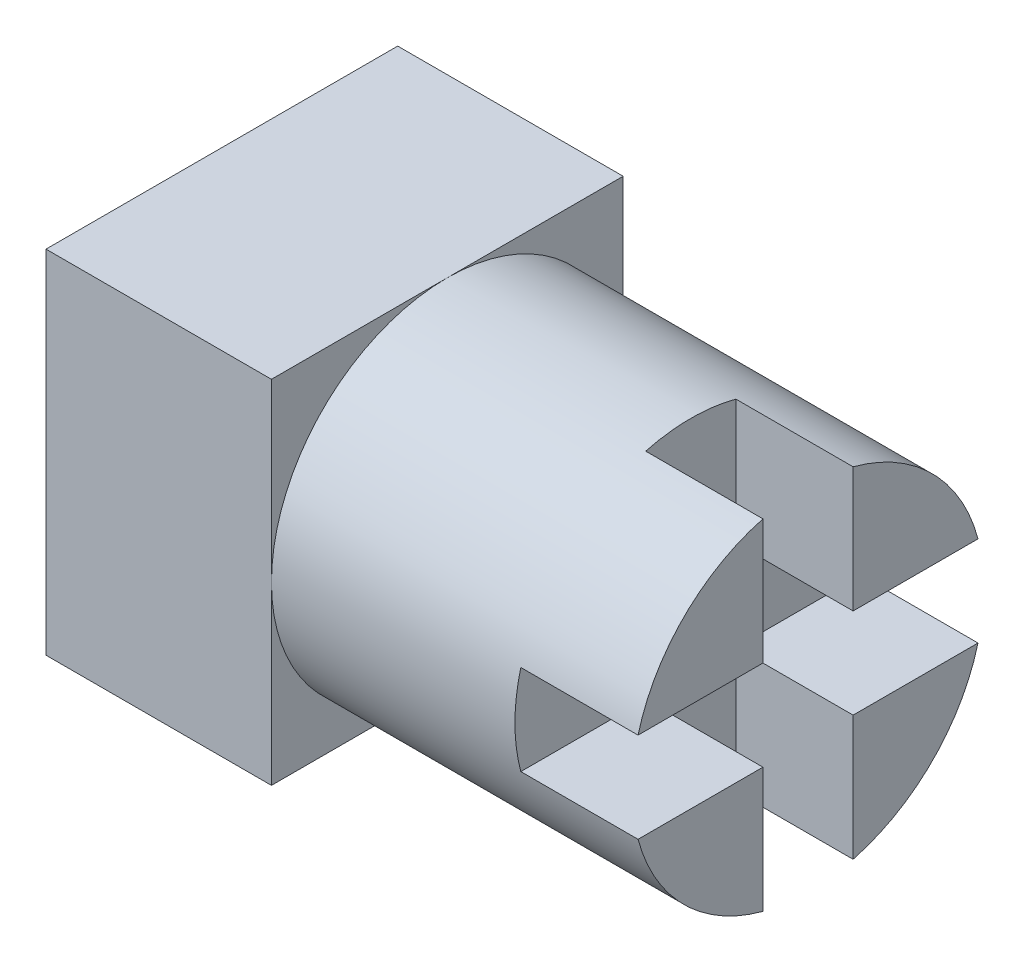
ISO-10303-21;
HEADER;
FILE_DESCRIPTION(('STEP AP214'),'2;1');
FILE_NAME('part.step','',(''),(''),'','','');
FILE_SCHEMA(('AUTOMOTIVE_DESIGN { 1 0 10303 214 1 1 1 1 }'));
ENDSEC;
DATA;
#1=APPLICATION_CONTEXT('core data for automotive mechanical design processes');
#2=APPLICATION_PROTOCOL_DEFINITION('international standard','automotive_design',2000,#1);
#3=PRODUCT_CONTEXT('',#1,'mechanical');
#4=PRODUCT('Part','Part','',(#3));
#5=PRODUCT_RELATED_PRODUCT_CATEGORY('part','',(#4));
#6=PRODUCT_DEFINITION_FORMATION('','',#4);
#7=PRODUCT_DEFINITION_CONTEXT('part definition',#1,'design');
#8=PRODUCT_DEFINITION('design','',#6,#7);
#9=PRODUCT_DEFINITION_SHAPE('','',#8);
#10=(LENGTH_UNIT() NAMED_UNIT(*) SI_UNIT(.MILLI.,.METRE.));
#11=(NAMED_UNIT(*) PLANE_ANGLE_UNIT() SI_UNIT($,.RADIAN.));
#12=(NAMED_UNIT(*) SI_UNIT($,.STERADIAN.) SOLID_ANGLE_UNIT());
#13=UNCERTAINTY_MEASURE_WITH_UNIT(LENGTH_MEASURE(1.E-05),#10,'distance_accuracy_value','');
#14=(GEOMETRIC_REPRESENTATION_CONTEXT(3) GLOBAL_UNCERTAINTY_ASSIGNED_CONTEXT((#13)) GLOBAL_UNIT_ASSIGNED_CONTEXT((#10,
#11,#12)) REPRESENTATION_CONTEXT('',''));
#15=CARTESIAN_POINT('',(0.,0.,0.));
#16=DIRECTION('',(0.,0.,1.));
#17=DIRECTION('',(1.,0.,0.));
#18=AXIS2_PLACEMENT_3D('',#15,#16,#17);
#19=CARTESIAN_POINT('',(26.,0.,0.));
#20=DIRECTION('',(-1.,0.,0.));
#21=DIRECTION('',(0.,0.,1.));
#22=AXIS2_PLACEMENT_3D('',#19,#20,#21);
#23=CYLINDRICAL_SURFACE('',#22,7.8);
#24=CARTESIAN_POINT('',(10.,0.,0.));
#25=DIRECTION('',(1.,0.,0.));
#26=DIRECTION('',(0.,0.,-1.));
#27=AXIS2_PLACEMENT_3D('',#24,#25,#26);
#28=CIRCLE('',#27,7.8);
#29=CARTESIAN_POINT('',(10.,0.,-7.8));
#30=VERTEX_POINT('',#29);
#31=CARTESIAN_POINT('',(10.,7.8,0.));
#32=VERTEX_POINT('',#31);
#33=EDGE_CURVE('E267',#30,#32,#28,.T.);
#34=ORIENTED_EDGE('',*,*,#33,.T.);
#35=CARTESIAN_POINT('',(10.,0.,7.8));
#36=VERTEX_POINT('',#35);
#37=EDGE_CURVE('E277',#32,#36,#28,.T.);
#38=ORIENTED_EDGE('',*,*,#37,.T.);
#39=CARTESIAN_POINT('',(10.,-7.8,0.));
#40=VERTEX_POINT('',#39);
#41=EDGE_CURVE('E443',#36,#40,#28,.T.);
#42=ORIENTED_EDGE('',*,*,#41,.T.);
#43=EDGE_CURVE('E68',#40,#30,#28,.T.);
#44=ORIENTED_EDGE('',*,*,#43,.T.);
#45=EDGE_LOOP('',(#34,#38,#42,#44));
#46=FACE_BOUND('',#45,.T.);
#47=CARTESIAN_POINT('',(26.,0.,0.));
#48=DIRECTION('',(1.,0.,0.));
#49=DIRECTION('',(0.,0.,-1.));
#50=AXIS2_PLACEMENT_3D('',#47,#48,#49);
#51=CIRCLE('',#50,7.8);
#52=CARTESIAN_POINT('',(26.,7.53923072998831,2.));
#53=VERTEX_POINT('',#52);
#54=CARTESIAN_POINT('',(26.,2.,7.53923072998831));
#55=VERTEX_POINT('',#54);
#56=EDGE_CURVE('E356',#53,#55,#51,.T.);
#57=ORIENTED_EDGE('',*,*,#56,.F.);
#58=DIRECTION('',(-1.,0.,0.));
#59=VECTOR('',#58,1.);
#60=CARTESIAN_POINT('',(26.,7.53923072998831,2.));
#61=LINE('',#60,#59);
#62=CARTESIAN_POINT('',(20.8,7.53923072998831,2.));
#63=VERTEX_POINT('',#62);
#64=EDGE_CURVE('E255',#53,#63,#61,.T.);
#65=ORIENTED_EDGE('',*,*,#64,.T.);
#66=CARTESIAN_POINT('',(20.8,0.,0.));
#67=DIRECTION('',(1.,0.,0.));
#68=DIRECTION('',(0.,0.,-1.));
#69=AXIS2_PLACEMENT_3D('',#66,#67,#68);
#70=CIRCLE('',#69,7.8);
#71=CARTESIAN_POINT('',(20.8,7.53923072998831,-2.));
#72=VERTEX_POINT('',#71);
#73=EDGE_CURVE('E11',#72,#63,#70,.T.);
#74=ORIENTED_EDGE('',*,*,#73,.F.);
#75=DIRECTION('',(-1.,0.,0.));
#76=VECTOR('',#75,1.);
#77=CARTESIAN_POINT('',(26.,7.53923072998831,-2.));
#78=LINE('',#77,#76);
#79=CARTESIAN_POINT('',(26.,7.53923072998831,-2.));
#80=VERTEX_POINT('',#79);
#81=EDGE_CURVE('E251',#80,#72,#78,.T.);
#82=ORIENTED_EDGE('',*,*,#81,.F.);
#83=CARTESIAN_POINT('',(26.,2.,-7.53923072998831));
#84=VERTEX_POINT('',#83);
#85=EDGE_CURVE('E273',#84,#80,#51,.T.);
#86=ORIENTED_EDGE('',*,*,#85,.F.);
#87=DIRECTION('',(-1.,0.,0.));
#88=VECTOR('',#87,1.);
#89=CARTESIAN_POINT('',(26.,2.,-7.53923072998831));
#90=LINE('',#89,#88);
#91=CARTESIAN_POINT('',(20.8,2.,-7.53923072998831));
#92=VERTEX_POINT('',#91);
#93=EDGE_CURVE('E248',#92,#84,#90,.F.);
#94=ORIENTED_EDGE('',*,*,#93,.F.);
#95=CARTESIAN_POINT('',(20.8,-2.,-7.53923072998831));
#96=VERTEX_POINT('',#95);
#97=EDGE_CURVE('E47',#96,#92,#70,.T.);
#98=ORIENTED_EDGE('',*,*,#97,.F.);
#99=DIRECTION('',(-1.,0.,0.));
#100=VECTOR('',#99,1.);
#101=CARTESIAN_POINT('',(26.,-2.,-7.53923072998831));
#102=LINE('',#101,#100);
#103=CARTESIAN_POINT('',(26.,-2.,-7.53923072998831));
#104=VERTEX_POINT('',#103);
#105=EDGE_CURVE('E192',#96,#104,#102,.F.);
#106=ORIENTED_EDGE('',*,*,#105,.T.);
#107=CARTESIAN_POINT('',(26.,-7.53923072998831,-2.));
#108=VERTEX_POINT('',#107);
#109=EDGE_CURVE('E268',#108,#104,#51,.T.);
#110=ORIENTED_EDGE('',*,*,#109,.F.);
#111=DIRECTION('',(1.,0.,0.));
#112=VECTOR('',#111,1.);
#113=CARTESIAN_POINT('',(20.8,-7.53923072998831,-2.));
#114=LINE('',#113,#112);
#115=CARTESIAN_POINT('',(20.8,-7.53923072998831,-2.));
#116=VERTEX_POINT('',#115);
#117=EDGE_CURVE('E229',#116,#108,#114,.T.);
#118=ORIENTED_EDGE('',*,*,#117,.F.);
#119=CARTESIAN_POINT('',(20.8,0.,0.));
#120=DIRECTION('',(1.,0.,0.));
#121=DIRECTION('',(0.,0.,-1.));
#122=AXIS2_PLACEMENT_3D('',#119,#120,#121);
#123=CIRCLE('',#122,7.8);
#124=CARTESIAN_POINT('',(20.8,-7.53923072998831,2.));
#125=VERTEX_POINT('',#124);
#126=EDGE_CURVE('E176',#125,#116,#123,.T.);
#127=ORIENTED_EDGE('',*,*,#126,.F.);
#128=DIRECTION('',(1.,0.,0.));
#129=VECTOR('',#128,1.);
#130=CARTESIAN_POINT('',(20.8,-7.53923072998831,2.));
#131=LINE('',#130,#129);
#132=CARTESIAN_POINT('',(26.,-7.53923072998831,2.));
#133=VERTEX_POINT('',#132);
#134=EDGE_CURVE('E232',#125,#133,#131,.T.);
#135=ORIENTED_EDGE('',*,*,#134,.T.);
#136=CARTESIAN_POINT('',(26.,-2.,7.53923072998831));
#137=VERTEX_POINT('',#136);
#138=EDGE_CURVE('E272',#137,#133,#51,.T.);
#139=ORIENTED_EDGE('',*,*,#138,.F.);
#140=DIRECTION('',(-1.,0.,0.));
#141=VECTOR('',#140,1.);
#142=CARTESIAN_POINT('',(26.,-2.,7.53923072998831));
#143=LINE('',#142,#141);
#144=CARTESIAN_POINT('',(20.8,-2.,7.53923072998831));
#145=VERTEX_POINT('',#144);
#146=EDGE_CURVE('E263',#137,#145,#143,.T.);
#147=ORIENTED_EDGE('',*,*,#146,.T.);
#148=CARTESIAN_POINT('',(20.8,2.,7.53923072998831));
#149=VERTEX_POINT('',#148);
#150=EDGE_CURVE('E53',#149,#145,#70,.T.);
#151=ORIENTED_EDGE('',*,*,#150,.F.);
#152=DIRECTION('',(-1.,0.,0.));
#153=VECTOR('',#152,1.);
#154=CARTESIAN_POINT('',(26.,2.,7.53923072998831));
#155=LINE('',#154,#153);
#156=EDGE_CURVE('E259',#55,#149,#155,.T.);
#157=ORIENTED_EDGE('',*,*,#156,.F.);
#158=EDGE_LOOP('',(#57,#65,#74,#82,#86,#94,#98,#106,#110,#118,#127,#135,#139,#147,#151,#157));
#159=FACE_BOUND('',#158,.T.);
#160=ADVANCED_FACE('F43',(#46,#159),#23,.T.);
#161=CARTESIAN_POINT('',(26.,0.,0.));
#162=DIRECTION('',(1.,0.,0.));
#163=DIRECTION('',(0.,0.,-1.));
#164=AXIS2_PLACEMENT_3D('',#161,#162,#163);
#165=PLANE('',#164);
#166=ORIENTED_EDGE('',*,*,#56,.T.);
#167=DIRECTION('',(0.,0.,-1.));
#168=VECTOR('',#167,1.);
#169=CARTESIAN_POINT('',(26.,2.,0.));
#170=LINE('',#169,#168);
#171=CARTESIAN_POINT('',(26.,2.,2.));
#172=VERTEX_POINT('',#171);
#173=EDGE_CURVE('E333',#55,#172,#170,.T.);
#174=ORIENTED_EDGE('',*,*,#173,.T.);
#175=DIRECTION('',(0.,-1.,0.));
#176=VECTOR('',#175,1.);
#177=CARTESIAN_POINT('',(26.,0.,2.));
#178=LINE('',#177,#176);
#179=EDGE_CURVE('E330',#53,#172,#178,.T.);
#180=ORIENTED_EDGE('',*,*,#179,.F.);
#181=EDGE_LOOP('',(#166,#174,#180));
#182=FACE_BOUND('',#181,.T.);
#183=ADVANCED_FACE('F385',(#182),#165,.T.);
#184=ORIENTED_EDGE('',*,*,#85,.T.);
#185=DIRECTION('',(0.,-1.,0.));
#186=VECTOR('',#185,1.);
#187=CARTESIAN_POINT('',(26.,0.,-2.));
#188=LINE('',#187,#186);
#189=CARTESIAN_POINT('',(26.,2.,-2.));
#190=VERTEX_POINT('',#189);
#191=EDGE_CURVE('E326',#80,#190,#188,.T.);
#192=ORIENTED_EDGE('',*,*,#191,.T.);
#193=DIRECTION('',(0.,0.,-1.));
#194=VECTOR('',#193,1.);
#195=CARTESIAN_POINT('',(26.,2.,0.));
#196=LINE('',#195,#194);
#197=EDGE_CURVE('E223',#190,#84,#196,.T.);
#198=ORIENTED_EDGE('',*,*,#197,.T.);
#199=EDGE_LOOP('',(#184,#192,#198));
#200=FACE_BOUND('',#199,.T.);
#201=ADVANCED_FACE('F365',(#200),#165,.T.);
#202=DIRECTION('',(0.,0.,-1.));
#203=VECTOR('',#202,1.);
#204=CARTESIAN_POINT('',(26.,-2.,0.));
#205=LINE('',#204,#203);
#206=CARTESIAN_POINT('',(26.,-2.,-2.));
#207=VERTEX_POINT('',#206);
#208=EDGE_CURVE('E220',#207,#104,#205,.T.);
#209=ORIENTED_EDGE('',*,*,#208,.F.);
#210=DIRECTION('',(0.,-1.,0.));
#211=VECTOR('',#210,1.);
#212=CARTESIAN_POINT('',(26.,0.,-2.));
#213=LINE('',#212,#211);
#214=EDGE_CURVE('E60',#207,#108,#213,.T.);
#215=ORIENTED_EDGE('',*,*,#214,.T.);
#216=ORIENTED_EDGE('',*,*,#109,.T.);
#217=EDGE_LOOP('',(#209,#215,#216));
#218=FACE_BOUND('',#217,.T.);
#219=ADVANCED_FACE('F454',(#218),#165,.T.);
#220=CARTESIAN_POINT('',(10.,0.,0.));
#221=DIRECTION('',(1.,0.,0.));
#222=DIRECTION('',(0.,0.,-1.));
#223=AXIS2_PLACEMENT_3D('',#220,#221,#222);
#224=PLANE('',#223);
#225=ORIENTED_EDGE('',*,*,#33,.F.);
#226=DIRECTION('',(0.,1.,0.));
#227=VECTOR('',#226,1.);
#228=CARTESIAN_POINT('',(10.,7.8,-7.8));
#229=LINE('',#228,#227);
#230=CARTESIAN_POINT('',(10.,7.8,-7.8));
#231=VERTEX_POINT('',#230);
#232=EDGE_CURVE('E282',#30,#231,#229,.T.);
#233=ORIENTED_EDGE('',*,*,#232,.T.);
#234=DIRECTION('',(0.,0.,1.));
#235=VECTOR('',#234,1.);
#236=CARTESIAN_POINT('',(10.,7.8,7.8));
#237=LINE('',#236,#235);
#238=EDGE_CURVE('E283',#231,#32,#237,.T.);
#239=ORIENTED_EDGE('',*,*,#238,.T.);
#240=EDGE_LOOP('',(#225,#233,#239));
#241=FACE_BOUND('',#240,.T.);
#242=ADVANCED_FACE('F400',(#241),#224,.T.);
#243=ORIENTED_EDGE('',*,*,#37,.F.);
#244=CARTESIAN_POINT('',(10.,7.8,7.8));
#245=VERTEX_POINT('',#244);
#246=EDGE_CURVE('E281',#32,#245,#237,.T.);
#247=ORIENTED_EDGE('',*,*,#246,.T.);
#248=DIRECTION('',(0.,-1.,0.));
#249=VECTOR('',#248,1.);
#250=CARTESIAN_POINT('',(10.,7.8,7.8));
#251=LINE('',#250,#249);
#252=EDGE_CURVE('E288',#245,#36,#251,.T.);
#253=ORIENTED_EDGE('',*,*,#252,.T.);
#254=EDGE_LOOP('',(#243,#247,#253));
#255=FACE_BOUND('',#254,.T.);
#256=ADVANCED_FACE('F439',(#255),#224,.T.);
#257=ORIENTED_EDGE('',*,*,#41,.F.);
#258=CARTESIAN_POINT('',(10.,-7.8,7.8));
#259=VERTEX_POINT('',#258);
#260=EDGE_CURVE('E287',#36,#259,#251,.T.);
#261=ORIENTED_EDGE('',*,*,#260,.T.);
#262=DIRECTION('',(0.,0.,-1.));
#263=VECTOR('',#262,1.);
#264=CARTESIAN_POINT('',(10.,-7.8,7.8));
#265=LINE('',#264,#263);
#266=EDGE_CURVE('E293',#259,#40,#265,.T.);
#267=ORIENTED_EDGE('',*,*,#266,.T.);
#268=EDGE_LOOP('',(#257,#261,#267));
#269=FACE_BOUND('',#268,.T.);
#270=ADVANCED_FACE('F401',(#269),#224,.T.);
#271=CARTESIAN_POINT('',(10.,7.8,-7.8));
#272=DIRECTION('',(0.,0.,1.));
#273=DIRECTION('',(0.,-1.,0.));
#274=AXIS2_PLACEMENT_3D('',#271,#272,#273);
#275=PLANE('',#274);
#276=DIRECTION('',(0.,1.,0.));
#277=VECTOR('',#276,1.);
#278=CARTESIAN_POINT('',(0.,7.8,-7.8));
#279=LINE('',#278,#277);
#280=CARTESIAN_POINT('',(0.,-7.8,-7.8));
#281=VERTEX_POINT('',#280);
#282=CARTESIAN_POINT('',(0.,7.8,-7.8));
#283=VERTEX_POINT('',#282);
#284=EDGE_CURVE('E298',#281,#283,#279,.T.);
#285=ORIENTED_EDGE('',*,*,#284,.T.);
#286=DIRECTION('',(-1.,0.,0.));
#287=VECTOR('',#286,1.);
#288=CARTESIAN_POINT('',(10.,7.8,-7.8));
#289=LINE('',#288,#287);
#290=EDGE_CURVE('E322',#231,#283,#289,.T.);
#291=ORIENTED_EDGE('',*,*,#290,.F.);
#292=ORIENTED_EDGE('',*,*,#232,.F.);
#293=CARTESIAN_POINT('',(10.,-7.8,-7.8));
#294=VERTEX_POINT('',#293);
#295=EDGE_CURVE('E278',#294,#30,#229,.T.);
#296=ORIENTED_EDGE('',*,*,#295,.F.);
#297=DIRECTION('',(-1.,0.,0.));
#298=VECTOR('',#297,1.);
#299=CARTESIAN_POINT('',(10.,-7.8,-7.8));
#300=LINE('',#299,#298);
#301=EDGE_CURVE('E297',#294,#281,#300,.T.);
#302=ORIENTED_EDGE('',*,*,#301,.T.);
#303=EDGE_LOOP('',(#285,#291,#292,#296,#302));
#304=FACE_BOUND('',#303,.T.);
#305=ADVANCED_FACE('F45',(#304),#275,.F.);
#306=CARTESIAN_POINT('',(10.,7.8,7.8));
#307=DIRECTION('',(0.,-1.,0.));
#308=DIRECTION('',(0.,0.,-1.));
#309=AXIS2_PLACEMENT_3D('',#306,#307,#308);
#310=PLANE('',#309);
#311=DIRECTION('',(0.,0.,1.));
#312=VECTOR('',#311,1.);
#313=CARTESIAN_POINT('',(0.,7.8,7.8));
#314=LINE('',#313,#312);
#315=CARTESIAN_POINT('',(0.,7.8,7.8));
#316=VERTEX_POINT('',#315);
#317=EDGE_CURVE('E302',#283,#316,#314,.T.);
#318=ORIENTED_EDGE('',*,*,#317,.T.);
#319=DIRECTION('',(-1.,0.,0.));
#320=VECTOR('',#319,1.);
#321=CARTESIAN_POINT('',(10.,7.8,7.8));
#322=LINE('',#321,#320);
#323=EDGE_CURVE('E318',#245,#316,#322,.T.);
#324=ORIENTED_EDGE('',*,*,#323,.F.);
#325=ORIENTED_EDGE('',*,*,#246,.F.);
#326=ORIENTED_EDGE('',*,*,#238,.F.);
#327=ORIENTED_EDGE('',*,*,#290,.T.);
#328=EDGE_LOOP('',(#318,#324,#325,#326,#327));
#329=FACE_BOUND('',#328,.T.);
#330=ADVANCED_FACE('F410',(#329),#310,.F.);
#331=CARTESIAN_POINT('',(10.,7.8,7.8));
#332=DIRECTION('',(0.,0.,-1.));
#333=DIRECTION('',(0.,1.,0.));
#334=AXIS2_PLACEMENT_3D('',#331,#332,#333);
#335=PLANE('',#334);
#336=DIRECTION('',(0.,-1.,0.));
#337=VECTOR('',#336,1.);
#338=CARTESIAN_POINT('',(0.,7.8,7.8));
#339=LINE('',#338,#337);
#340=CARTESIAN_POINT('',(0.,-7.8,7.8));
#341=VERTEX_POINT('',#340);
#342=EDGE_CURVE('E305',#316,#341,#339,.T.);
#343=ORIENTED_EDGE('',*,*,#342,.T.);
#344=DIRECTION('',(-1.,0.,0.));
#345=VECTOR('',#344,1.);
#346=CARTESIAN_POINT('',(10.,-7.8,7.8));
#347=LINE('',#346,#345);
#348=EDGE_CURVE('E314',#259,#341,#347,.T.);
#349=ORIENTED_EDGE('',*,*,#348,.F.);
#350=ORIENTED_EDGE('',*,*,#260,.F.);
#351=ORIENTED_EDGE('',*,*,#252,.F.);
#352=ORIENTED_EDGE('',*,*,#323,.T.);
#353=EDGE_LOOP('',(#343,#349,#350,#351,#352));
#354=FACE_BOUND('',#353,.T.);
#355=ADVANCED_FACE('F407',(#354),#335,.F.);
#356=CARTESIAN_POINT('',(10.,-7.8,7.8));
#357=DIRECTION('',(0.,1.,0.));
#358=DIRECTION('',(0.,0.,1.));
#359=AXIS2_PLACEMENT_3D('',#356,#357,#358);
#360=PLANE('',#359);
#361=DIRECTION('',(0.,0.,-1.));
#362=VECTOR('',#361,1.);
#363=CARTESIAN_POINT('',(0.,-7.8,7.8));
#364=LINE('',#363,#362);
#365=EDGE_CURVE('E308',#341,#281,#364,.T.);
#366=ORIENTED_EDGE('',*,*,#365,.T.);
#367=ORIENTED_EDGE('',*,*,#301,.F.);
#368=EDGE_CURVE('E292',#40,#294,#265,.T.);
#369=ORIENTED_EDGE('',*,*,#368,.F.);
#370=ORIENTED_EDGE('',*,*,#266,.F.);
#371=ORIENTED_EDGE('',*,*,#348,.T.);
#372=EDGE_LOOP('',(#366,#367,#369,#370,#371));
#373=FACE_BOUND('',#372,.T.);
#374=ADVANCED_FACE('F399',(#373),#360,.F.);
#375=ORIENTED_EDGE('',*,*,#43,.F.);
#376=ORIENTED_EDGE('',*,*,#368,.T.);
#377=ORIENTED_EDGE('',*,*,#295,.T.);
#378=EDGE_LOOP('',(#375,#376,#377));
#379=FACE_BOUND('',#378,.T.);
#380=ADVANCED_FACE('F395',(#379),#224,.T.);
#381=CARTESIAN_POINT('',(0.,0.,0.));
#382=DIRECTION('',(1.,0.,0.));
#383=DIRECTION('',(0.,0.,-1.));
#384=AXIS2_PLACEMENT_3D('',#381,#382,#383);
#385=PLANE('',#384);
#386=ORIENTED_EDGE('',*,*,#284,.F.);
#387=ORIENTED_EDGE('',*,*,#365,.F.);
#388=ORIENTED_EDGE('',*,*,#342,.F.);
#389=ORIENTED_EDGE('',*,*,#317,.F.);
#390=EDGE_LOOP('',(#386,#387,#388,#389));
#391=FACE_BOUND('',#390,.T.);
#392=ADVANCED_FACE('F398',(#391),#385,.F.);
#393=DIRECTION('',(0.,-1.,0.));
#394=VECTOR('',#393,1.);
#395=CARTESIAN_POINT('',(26.,0.,2.));
#396=LINE('',#395,#394);
#397=CARTESIAN_POINT('',(26.,-2.,2.));
#398=VERTEX_POINT('',#397);
#399=EDGE_CURVE('E188',#398,#133,#396,.T.);
#400=ORIENTED_EDGE('',*,*,#399,.F.);
#401=DIRECTION('',(0.,0.,-1.));
#402=VECTOR('',#401,1.);
#403=CARTESIAN_POINT('',(26.,-2.,0.));
#404=LINE('',#403,#402);
#405=EDGE_CURVE('E336',#137,#398,#404,.T.);
#406=ORIENTED_EDGE('',*,*,#405,.F.);
#407=ORIENTED_EDGE('',*,*,#138,.T.);
#408=EDGE_LOOP('',(#400,#406,#407));
#409=FACE_BOUND('',#408,.T.);
#410=ADVANCED_FACE('F392',(#409),#165,.T.);
#411=CARTESIAN_POINT('',(20.8,0.,0.));
#412=DIRECTION('',(1.,0.,0.));
#413=DIRECTION('',(0.,0.,-1.));
#414=AXIS2_PLACEMENT_3D('',#411,#412,#413);
#415=PLANE('',#414);
#416=DIRECTION('',(0.,-1.,0.));
#417=VECTOR('',#416,1.);
#418=CARTESIAN_POINT('',(20.8,0.,-2.));
#419=LINE('',#418,#417);
#420=CARTESIAN_POINT('',(20.8,2.,-2.));
#421=VERTEX_POINT('',#420);
#422=EDGE_CURVE('E198',#72,#421,#419,.T.);
#423=ORIENTED_EDGE('',*,*,#422,.F.);
#424=ORIENTED_EDGE('',*,*,#73,.T.);
#425=DIRECTION('',(0.,-1.,0.));
#426=VECTOR('',#425,1.);
#427=CARTESIAN_POINT('',(20.8,0.,2.));
#428=LINE('',#427,#426);
#429=CARTESIAN_POINT('',(20.8,2.,2.));
#430=VERTEX_POINT('',#429);
#431=EDGE_CURVE('E203',#63,#430,#428,.T.);
#432=ORIENTED_EDGE('',*,*,#431,.T.);
#433=DIRECTION('',(0.,0.,-1.));
#434=VECTOR('',#433,1.);
#435=CARTESIAN_POINT('',(20.8,2.,0.));
#436=LINE('',#435,#434);
#437=EDGE_CURVE('E207',#149,#430,#436,.T.);
#438=ORIENTED_EDGE('',*,*,#437,.F.);
#439=ORIENTED_EDGE('',*,*,#150,.T.);
#440=DIRECTION('',(0.,0.,-1.));
#441=VECTOR('',#440,1.);
#442=CARTESIAN_POINT('',(20.8,-2.,0.));
#443=LINE('',#442,#441);
#444=CARTESIAN_POINT('',(20.8,-2.,2.));
#445=VERTEX_POINT('',#444);
#446=EDGE_CURVE('E210',#145,#445,#443,.T.);
#447=ORIENTED_EDGE('',*,*,#446,.T.);
#448=DIRECTION('',(0.,-1.,0.));
#449=VECTOR('',#448,1.);
#450=CARTESIAN_POINT('',(20.8,0.,2.));
#451=LINE('',#450,#449);
#452=EDGE_CURVE('E213',#445,#125,#451,.T.);
#453=ORIENTED_EDGE('',*,*,#452,.T.);
#454=ORIENTED_EDGE('',*,*,#126,.T.);
#455=DIRECTION('',(0.,-1.,0.));
#456=VECTOR('',#455,1.);
#457=CARTESIAN_POINT('',(20.8,0.,-2.));
#458=LINE('',#457,#456);
#459=CARTESIAN_POINT('',(20.8,-2.,-2.));
#460=VERTEX_POINT('',#459);
#461=EDGE_CURVE('E169',#460,#116,#458,.T.);
#462=ORIENTED_EDGE('',*,*,#461,.F.);
#463=DIRECTION('',(0.,0.,-1.));
#464=VECTOR('',#463,1.);
#465=CARTESIAN_POINT('',(20.8,-2.,0.));
#466=LINE('',#465,#464);
#467=EDGE_CURVE('E182',#460,#96,#466,.T.);
#468=ORIENTED_EDGE('',*,*,#467,.T.);
#469=ORIENTED_EDGE('',*,*,#97,.T.);
#470=DIRECTION('',(0.,0.,-1.));
#471=VECTOR('',#470,1.);
#472=CARTESIAN_POINT('',(20.8,2.,0.));
#473=LINE('',#472,#471);
#474=EDGE_CURVE('E194',#421,#92,#473,.T.);
#475=ORIENTED_EDGE('',*,*,#474,.F.);
#476=EDGE_LOOP('',(#423,#424,#432,#438,#439,#447,#453,#454,#462,#468,#469,#475));
#477=FACE_BOUND('',#476,.T.);
#478=ADVANCED_FACE('F181',(#477),#415,.T.);
#479=CARTESIAN_POINT('',(20.8,-2.,0.));
#480=DIRECTION('',(0.,-1.,0.));
#481=DIRECTION('',(0.,0.,-1.));
#482=AXIS2_PLACEMENT_3D('',#479,#480,#481);
#483=PLANE('',#482);
#484=ORIENTED_EDGE('',*,*,#405,.T.);
#485=DIRECTION('',(1.,0.,0.));
#486=VECTOR('',#485,1.);
#487=CARTESIAN_POINT('',(20.8,-2.,2.));
#488=LINE('',#487,#486);
#489=EDGE_CURVE('E236',#445,#398,#488,.T.);
#490=ORIENTED_EDGE('',*,*,#489,.F.);
#491=ORIENTED_EDGE('',*,*,#446,.F.);
#492=ORIENTED_EDGE('',*,*,#146,.F.);
#493=EDGE_LOOP('',(#484,#490,#491,#492));
#494=FACE_BOUND('',#493,.T.);
#495=ADVANCED_FACE('F348',(#494),#483,.F.);
#496=CARTESIAN_POINT('',(20.8,2.,0.));
#497=DIRECTION('',(0.,-1.,0.));
#498=DIRECTION('',(0.,0.,-1.));
#499=AXIS2_PLACEMENT_3D('',#496,#497,#498);
#500=PLANE('',#499);
#501=ORIENTED_EDGE('',*,*,#156,.T.);
#502=ORIENTED_EDGE('',*,*,#437,.T.);
#503=DIRECTION('',(1.,0.,0.));
#504=VECTOR('',#503,1.);
#505=CARTESIAN_POINT('',(20.8,2.,2.));
#506=LINE('',#505,#504);
#507=EDGE_CURVE('E240',#430,#172,#506,.T.);
#508=ORIENTED_EDGE('',*,*,#507,.T.);
#509=ORIENTED_EDGE('',*,*,#173,.F.);
#510=EDGE_LOOP('',(#501,#502,#508,#509));
#511=FACE_BOUND('',#510,.T.);
#512=ADVANCED_FACE('F478',(#511),#500,.T.);
#513=CARTESIAN_POINT('',(20.8,0.,2.));
#514=DIRECTION('',(0.,0.,1.));
#515=DIRECTION('',(1.,0.,0.));
#516=AXIS2_PLACEMENT_3D('',#513,#514,#515);
#517=PLANE('',#516);
#518=ORIENTED_EDGE('',*,*,#179,.T.);
#519=ORIENTED_EDGE('',*,*,#507,.F.);
#520=ORIENTED_EDGE('',*,*,#431,.F.);
#521=ORIENTED_EDGE('',*,*,#64,.F.);
#522=EDGE_LOOP('',(#518,#519,#520,#521));
#523=FACE_BOUND('',#522,.T.);
#524=ADVANCED_FACE('F382',(#523),#517,.F.);
#525=CARTESIAN_POINT('',(20.8,0.,-2.));
#526=DIRECTION('',(0.,0.,1.));
#527=DIRECTION('',(1.,0.,0.));
#528=AXIS2_PLACEMENT_3D('',#525,#526,#527);
#529=PLANE('',#528);
#530=ORIENTED_EDGE('',*,*,#81,.T.);
#531=ORIENTED_EDGE('',*,*,#422,.T.);
#532=DIRECTION('',(1.,0.,0.));
#533=VECTOR('',#532,1.);
#534=CARTESIAN_POINT('',(20.8,2.,-2.));
#535=LINE('',#534,#533);
#536=EDGE_CURVE('E175',#421,#190,#535,.T.);
#537=ORIENTED_EDGE('',*,*,#536,.T.);
#538=ORIENTED_EDGE('',*,*,#191,.F.);
#539=EDGE_LOOP('',(#530,#531,#537,#538));
#540=FACE_BOUND('',#539,.T.);
#541=ADVANCED_FACE('F370',(#540),#529,.T.);
#542=CARTESIAN_POINT('',(20.8,2.,0.));
#543=DIRECTION('',(0.,-1.,0.));
#544=DIRECTION('',(0.,0.,-1.));
#545=AXIS2_PLACEMENT_3D('',#542,#543,#544);
#546=PLANE('',#545);
#547=ORIENTED_EDGE('',*,*,#93,.T.);
#548=ORIENTED_EDGE('',*,*,#197,.F.);
#549=ORIENTED_EDGE('',*,*,#536,.F.);
#550=ORIENTED_EDGE('',*,*,#474,.T.);
#551=EDGE_LOOP('',(#547,#548,#549,#550));
#552=FACE_BOUND('',#551,.T.);
#553=ADVANCED_FACE('F374',(#552),#546,.T.);
#554=CARTESIAN_POINT('',(20.8,-2.,0.));
#555=DIRECTION('',(0.,-1.,0.));
#556=DIRECTION('',(0.,0.,-1.));
#557=AXIS2_PLACEMENT_3D('',#554,#555,#556);
#558=PLANE('',#557);
#559=ORIENTED_EDGE('',*,*,#467,.F.);
#560=DIRECTION('',(1.,0.,0.));
#561=VECTOR('',#560,1.);
#562=CARTESIAN_POINT('',(20.8,-2.,-2.));
#563=LINE('',#562,#561);
#564=EDGE_CURVE('E166',#460,#207,#563,.T.);
#565=ORIENTED_EDGE('',*,*,#564,.T.);
#566=ORIENTED_EDGE('',*,*,#208,.T.);
#567=ORIENTED_EDGE('',*,*,#105,.F.);
#568=EDGE_LOOP('',(#559,#565,#566,#567));
#569=FACE_BOUND('',#568,.T.);
#570=ADVANCED_FACE('F190',(#569),#558,.F.);
#571=CARTESIAN_POINT('',(20.8,0.,-2.));
#572=DIRECTION('',(0.,0.,1.));
#573=DIRECTION('',(1.,0.,0.));
#574=AXIS2_PLACEMENT_3D('',#571,#572,#573);
#575=PLANE('',#574);
#576=ORIENTED_EDGE('',*,*,#214,.F.);
#577=ORIENTED_EDGE('',*,*,#564,.F.);
#578=ORIENTED_EDGE('',*,*,#461,.T.);
#579=ORIENTED_EDGE('',*,*,#117,.T.);
#580=EDGE_LOOP('',(#576,#577,#578,#579));
#581=FACE_BOUND('',#580,.T.);
#582=ADVANCED_FACE('F168',(#581),#575,.T.);
#583=CARTESIAN_POINT('',(20.8,0.,2.));
#584=DIRECTION('',(0.,0.,1.));
#585=DIRECTION('',(1.,0.,0.));
#586=AXIS2_PLACEMENT_3D('',#583,#584,#585);
#587=PLANE('',#586);
#588=ORIENTED_EDGE('',*,*,#399,.T.);
#589=ORIENTED_EDGE('',*,*,#134,.F.);
#590=ORIENTED_EDGE('',*,*,#452,.F.);
#591=ORIENTED_EDGE('',*,*,#489,.T.);
#592=EDGE_LOOP('',(#588,#589,#590,#591));
#593=FACE_BOUND('',#592,.T.);
#594=ADVANCED_FACE('F468',(#593),#587,.F.);
#595=CLOSED_SHELL('',(#160,#183,#201,#219,#242,#256,#270,#305,#330,#355,#374,#380,#392,#410,
#478,#495,#512,#524,#541,#553,#570,#582,#594));
#596=MANIFOLD_SOLID_BREP('B2',#595);
#597=ADVANCED_BREP_SHAPE_REPRESENTATION('',(#18,#596),#14);
#598=SHAPE_DEFINITION_REPRESENTATION(#9,#597);
ENDSEC;
END-ISO-10303-21;
